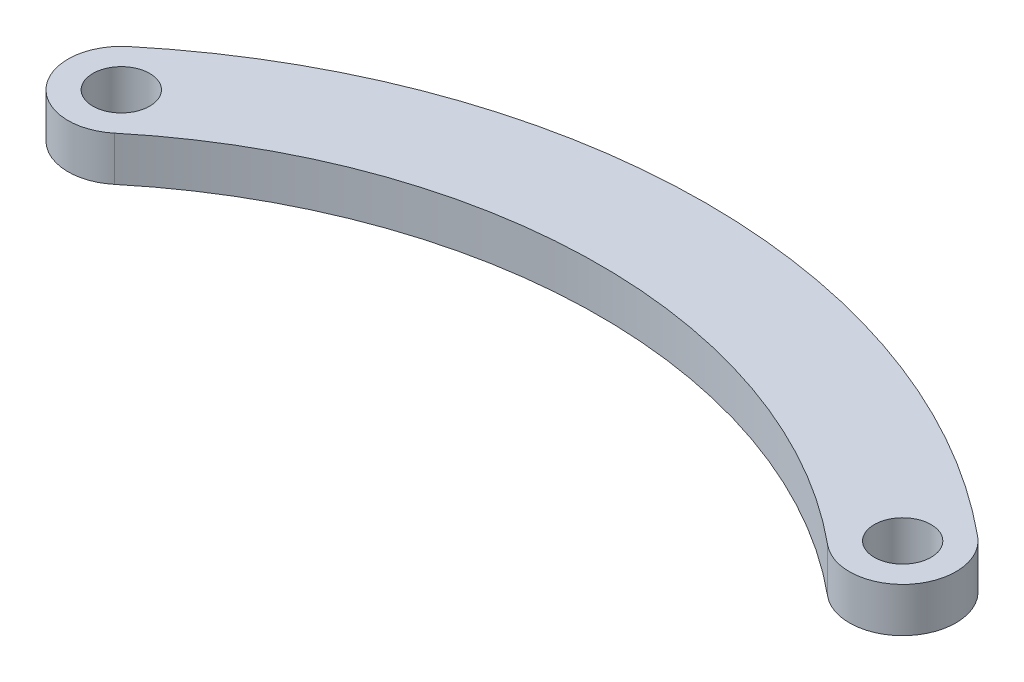
ISO-10303-21;
HEADER;
FILE_DESCRIPTION(('STEP AP214'),'2;1');
FILE_NAME('part.step','',(''),(''),'','','');
FILE_SCHEMA(('AUTOMOTIVE_DESIGN { 1 0 10303 214 1 1 1 1 }'));
ENDSEC;
DATA;
#1=APPLICATION_CONTEXT('core data for automotive mechanical design processes');
#2=APPLICATION_PROTOCOL_DEFINITION('international standard','automotive_design',2000,#1);
#3=PRODUCT_CONTEXT('',#1,'mechanical');
#4=PRODUCT('Part','Part','',(#3));
#5=PRODUCT_RELATED_PRODUCT_CATEGORY('part','',(#4));
#6=PRODUCT_DEFINITION_FORMATION('','',#4);
#7=PRODUCT_DEFINITION_CONTEXT('part definition',#1,'design');
#8=PRODUCT_DEFINITION('design','',#6,#7);
#9=PRODUCT_DEFINITION_SHAPE('','',#8);
#10=(LENGTH_UNIT() NAMED_UNIT(*) SI_UNIT(.MILLI.,.METRE.));
#11=(NAMED_UNIT(*) PLANE_ANGLE_UNIT() SI_UNIT($,.RADIAN.));
#12=(NAMED_UNIT(*) SI_UNIT($,.STERADIAN.) SOLID_ANGLE_UNIT());
#13=UNCERTAINTY_MEASURE_WITH_UNIT(LENGTH_MEASURE(1.E-05),#10,'distance_accuracy_value','');
#14=(GEOMETRIC_REPRESENTATION_CONTEXT(3) GLOBAL_UNCERTAINTY_ASSIGNED_CONTEXT((#13)) GLOBAL_UNIT_ASSIGNED_CONTEXT((#10,
#11,#12)) REPRESENTATION_CONTEXT('',''));
#15=CARTESIAN_POINT('',(0.,0.,0.));
#16=DIRECTION('',(0.,0.,1.));
#17=DIRECTION('',(1.,0.,0.));
#18=AXIS2_PLACEMENT_3D('',#15,#16,#17);
#19=CARTESIAN_POINT('',(33.,2.5,13.2589572246069));
#20=DIRECTION('',(0.,1.,0.));
#21=DIRECTION('',(0.,0.,1.));
#22=AXIS2_PLACEMENT_3D('',#19,#20,#21);
#23=PLANE('',#22);
#24=CARTESIAN_POINT('',(0.,2.5,0.));
#25=DIRECTION('',(0.,1.,0.));
#26=DIRECTION('',(0.,0.,1.));
#27=AXIS2_PLACEMENT_3D('',#24,#25,#26);
#28=CIRCLE('',#27,1.6);
#29=CARTESIAN_POINT('',(0.,2.5,1.6));
#30=VERTEX_POINT('',#29);
#31=EDGE_CURVE('E104',#30,#30,#28,.T.);
#32=ORIENTED_EDGE('',*,*,#31,.F.);
#33=EDGE_LOOP('',(#32));
#34=FACE_BOUND('',#33,.T.);
#35=CARTESIAN_POINT('',(44.,2.5,0.));
#36=DIRECTION('',(0.,1.,0.));
#37=DIRECTION('',(0.,0.,1.));
#38=AXIS2_PLACEMENT_3D('',#35,#36,#37);
#39=CIRCLE('',#38,3.);
#40=CARTESIAN_POINT('',(42.0845005545766,2.5,2.3088659282389));
#41=VERTEX_POINT('',#40);
#42=CARTESIAN_POINT('',(45.9154994454234,2.5,-2.3088659282389));
#43=VERTEX_POINT('',#42);
#44=EDGE_CURVE('E89',#41,#43,#39,.T.);
#45=ORIENTED_EDGE('',*,*,#44,.T.);
#46=CARTESIAN_POINT('',(22.,2.5,26.5179144492139));
#47=DIRECTION('',(0.,1.,0.));
#48=DIRECTION('',(0.,0.,1.));
#49=AXIS2_PLACEMENT_3D('',#46,#47,#48);
#50=CIRCLE('',#49,37.4557656530199);
#51=CARTESIAN_POINT('',(-1.91549944542345,2.5,-2.30886592823891));
#52=VERTEX_POINT('',#51);
#53=EDGE_CURVE('E84',#43,#52,#50,.T.);
#54=ORIENTED_EDGE('',*,*,#53,.T.);
#55=CARTESIAN_POINT('',(0.,2.5,0.));
#56=DIRECTION('',(0.,1.,0.));
#57=DIRECTION('',(0.,0.,1.));
#58=AXIS2_PLACEMENT_3D('',#55,#56,#57);
#59=CIRCLE('',#58,3.);
#60=CARTESIAN_POINT('',(1.91549944542344,2.5,2.30886592823889));
#61=VERTEX_POINT('',#60);
#62=EDGE_CURVE('E87',#52,#61,#59,.T.);
#63=ORIENTED_EDGE('',*,*,#62,.T.);
#64=CARTESIAN_POINT('',(22.,2.5,26.5179144492139));
#65=DIRECTION('',(0.,-1.,0.));
#66=DIRECTION('',(0.,0.,1.));
#67=AXIS2_PLACEMENT_3D('',#64,#65,#66);
#68=CIRCLE('',#67,31.4557656530199);
#69=EDGE_CURVE('E54',#61,#41,#68,.T.);
#70=ORIENTED_EDGE('',*,*,#69,.T.);
#71=EDGE_LOOP('',(#45,#54,#63,#70));
#72=FACE_BOUND('',#71,.T.);
#73=CARTESIAN_POINT('',(44.,2.5,0.));
#74=DIRECTION('',(0.,1.,0.));
#75=DIRECTION('',(0.,0.,1.));
#76=AXIS2_PLACEMENT_3D('',#73,#74,#75);
#77=CIRCLE('',#76,1.6);
#78=CARTESIAN_POINT('',(44.,2.5,1.6));
#79=VERTEX_POINT('',#78);
#80=EDGE_CURVE('E119',#79,#79,#77,.T.);
#81=ORIENTED_EDGE('',*,*,#80,.F.);
#82=EDGE_LOOP('',(#81));
#83=FACE_BOUND('',#82,.T.);
#84=ADVANCED_FACE('F37',(#34,#72,#83),#23,.T.);
#85=CARTESIAN_POINT('',(33.,0.,13.2589572246069));
#86=DIRECTION('',(0.,1.,0.));
#87=DIRECTION('',(0.,0.,1.));
#88=AXIS2_PLACEMENT_3D('',#85,#86,#87);
#89=PLANE('',#88);
#90=CARTESIAN_POINT('',(44.,0.,0.));
#91=DIRECTION('',(0.,1.,0.));
#92=DIRECTION('',(0.,0.,1.));
#93=AXIS2_PLACEMENT_3D('',#90,#91,#92);
#94=CIRCLE('',#93,3.);
#95=CARTESIAN_POINT('',(42.0845005545766,0.,2.3088659282389));
#96=VERTEX_POINT('',#95);
#97=CARTESIAN_POINT('',(45.9154994454234,0.,-2.3088659282389));
#98=VERTEX_POINT('',#97);
#99=EDGE_CURVE('E101',#96,#98,#94,.T.);
#100=ORIENTED_EDGE('',*,*,#99,.F.);
#101=CARTESIAN_POINT('',(22.,0.,26.5179144492139));
#102=DIRECTION('',(0.,-1.,0.));
#103=DIRECTION('',(0.,0.,1.));
#104=AXIS2_PLACEMENT_3D('',#101,#102,#103);
#105=CIRCLE('',#104,31.4557656530199);
#106=CARTESIAN_POINT('',(1.91549944542344,0.,2.30886592823889));
#107=VERTEX_POINT('',#106);
#108=EDGE_CURVE('E77',#107,#96,#105,.T.);
#109=ORIENTED_EDGE('',*,*,#108,.F.);
#110=CARTESIAN_POINT('',(0.,0.,0.));
#111=DIRECTION('',(0.,1.,0.));
#112=DIRECTION('',(0.,0.,1.));
#113=AXIS2_PLACEMENT_3D('',#110,#111,#112);
#114=CIRCLE('',#113,3.);
#115=CARTESIAN_POINT('',(-1.91549944542345,0.,-2.30886592823891));
#116=VERTEX_POINT('',#115);
#117=EDGE_CURVE('E71',#116,#107,#114,.T.);
#118=ORIENTED_EDGE('',*,*,#117,.F.);
#119=CARTESIAN_POINT('',(22.,0.,26.5179144492139));
#120=DIRECTION('',(0.,1.,0.));
#121=DIRECTION('',(0.,0.,1.));
#122=AXIS2_PLACEMENT_3D('',#119,#120,#121);
#123=CIRCLE('',#122,37.4557656530199);
#124=EDGE_CURVE('E93',#98,#116,#123,.T.);
#125=ORIENTED_EDGE('',*,*,#124,.F.);
#126=EDGE_LOOP('',(#100,#109,#118,#125));
#127=FACE_BOUND('',#126,.T.);
#128=CARTESIAN_POINT('',(0.,0.,0.));
#129=DIRECTION('',(0.,1.,0.));
#130=DIRECTION('',(0.,0.,1.));
#131=AXIS2_PLACEMENT_3D('',#128,#129,#130);
#132=CIRCLE('',#131,1.6);
#133=CARTESIAN_POINT('',(0.,0.,1.6));
#134=VERTEX_POINT('',#133);
#135=EDGE_CURVE('E116',#134,#134,#132,.T.);
#136=ORIENTED_EDGE('',*,*,#135,.T.);
#137=EDGE_LOOP('',(#136));
#138=FACE_BOUND('',#137,.T.);
#139=CARTESIAN_POINT('',(44.,0.,0.));
#140=DIRECTION('',(0.,1.,0.));
#141=DIRECTION('',(0.,0.,1.));
#142=AXIS2_PLACEMENT_3D('',#139,#140,#141);
#143=CIRCLE('',#142,1.6);
#144=CARTESIAN_POINT('',(44.,0.,1.6));
#145=VERTEX_POINT('',#144);
#146=EDGE_CURVE('E122',#145,#145,#143,.T.);
#147=ORIENTED_EDGE('',*,*,#146,.T.);
#148=EDGE_LOOP('',(#147));
#149=FACE_BOUND('',#148,.T.);
#150=ADVANCED_FACE('F112',(#127,#138,#149),#89,.F.);
#151=CARTESIAN_POINT('',(44.,2.5,0.));
#152=DIRECTION('',(0.,-1.,0.));
#153=DIRECTION('',(0.,0.,-1.));
#154=AXIS2_PLACEMENT_3D('',#151,#152,#153);
#155=CYLINDRICAL_SURFACE('',#154,3.);
#156=ORIENTED_EDGE('',*,*,#99,.T.);
#157=DIRECTION('',(0.,-1.,0.));
#158=VECTOR('',#157,1.);
#159=CARTESIAN_POINT('',(45.9154994454234,2.5,-2.3088659282389));
#160=LINE('',#159,#158);
#161=EDGE_CURVE('E11',#43,#98,#160,.T.);
#162=ORIENTED_EDGE('',*,*,#161,.F.);
#163=ORIENTED_EDGE('',*,*,#44,.F.);
#164=DIRECTION('',(0.,-1.,0.));
#165=VECTOR('',#164,1.);
#166=CARTESIAN_POINT('',(42.0845005545766,2.5,2.3088659282389));
#167=LINE('',#166,#165);
#168=EDGE_CURVE('E97',#41,#96,#167,.T.);
#169=ORIENTED_EDGE('',*,*,#168,.T.);
#170=EDGE_LOOP('',(#156,#162,#163,#169));
#171=FACE_BOUND('',#170,.T.);
#172=ADVANCED_FACE('F39',(#171),#155,.T.);
#173=CARTESIAN_POINT('',(22.,2.5,26.5179144492139));
#174=DIRECTION('',(0.,-1.,0.));
#175=DIRECTION('',(0.,0.,-1.));
#176=AXIS2_PLACEMENT_3D('',#173,#174,#175);
#177=CYLINDRICAL_SURFACE('',#176,37.4557656530199);
#178=ORIENTED_EDGE('',*,*,#124,.T.);
#179=DIRECTION('',(0.,-1.,0.));
#180=VECTOR('',#179,1.);
#181=CARTESIAN_POINT('',(-1.91549944542345,2.5,-2.30886592823891));
#182=LINE('',#181,#180);
#183=EDGE_CURVE('E46',#52,#116,#182,.T.);
#184=ORIENTED_EDGE('',*,*,#183,.F.);
#185=ORIENTED_EDGE('',*,*,#53,.F.);
#186=ORIENTED_EDGE('',*,*,#161,.T.);
#187=EDGE_LOOP('',(#178,#184,#185,#186));
#188=FACE_BOUND('',#187,.T.);
#189=ADVANCED_FACE('F92',(#188),#177,.T.);
#190=CARTESIAN_POINT('',(0.,2.5,0.));
#191=DIRECTION('',(0.,-1.,0.));
#192=DIRECTION('',(0.,0.,-1.));
#193=AXIS2_PLACEMENT_3D('',#190,#191,#192);
#194=CYLINDRICAL_SURFACE('',#193,3.);
#195=ORIENTED_EDGE('',*,*,#117,.T.);
#196=DIRECTION('',(0.,-1.,0.));
#197=VECTOR('',#196,1.);
#198=CARTESIAN_POINT('',(1.91549944542344,2.5,2.30886592823889));
#199=LINE('',#198,#197);
#200=EDGE_CURVE('E94',#61,#107,#199,.T.);
#201=ORIENTED_EDGE('',*,*,#200,.F.);
#202=ORIENTED_EDGE('',*,*,#62,.F.);
#203=ORIENTED_EDGE('',*,*,#183,.T.);
#204=EDGE_LOOP('',(#195,#201,#202,#203));
#205=FACE_BOUND('',#204,.T.);
#206=ADVANCED_FACE('F95',(#205),#194,.T.);
#207=CARTESIAN_POINT('',(22.,2.5,26.5179144492139));
#208=DIRECTION('',(0.,-1.,0.));
#209=DIRECTION('',(0.,0.,-1.));
#210=AXIS2_PLACEMENT_3D('',#207,#208,#209);
#211=CYLINDRICAL_SURFACE('',#210,31.4557656530199);
#212=ORIENTED_EDGE('',*,*,#108,.T.);
#213=ORIENTED_EDGE('',*,*,#168,.F.);
#214=ORIENTED_EDGE('',*,*,#69,.F.);
#215=ORIENTED_EDGE('',*,*,#200,.T.);
#216=EDGE_LOOP('',(#212,#213,#214,#215));
#217=FACE_BOUND('',#216,.T.);
#218=ADVANCED_FACE('F109',(#217),#211,.F.);
#219=CARTESIAN_POINT('',(0.,2.5,0.));
#220=DIRECTION('',(0.,-1.,0.));
#221=DIRECTION('',(0.,0.,-1.));
#222=AXIS2_PLACEMENT_3D('',#219,#220,#221);
#223=CYLINDRICAL_SURFACE('',#222,1.6);
#224=ORIENTED_EDGE('',*,*,#31,.T.);
#225=EDGE_LOOP('',(#224));
#226=FACE_BOUND('',#225,.T.);
#227=ORIENTED_EDGE('',*,*,#135,.F.);
#228=EDGE_LOOP('',(#227));
#229=FACE_BOUND('',#228,.T.);
#230=ADVANCED_FACE('F139',(#226,#229),#223,.F.);
#231=CARTESIAN_POINT('',(44.,2.5,0.));
#232=DIRECTION('',(0.,-1.,0.));
#233=DIRECTION('',(0.,0.,-1.));
#234=AXIS2_PLACEMENT_3D('',#231,#232,#233);
#235=CYLINDRICAL_SURFACE('',#234,1.6);
#236=ORIENTED_EDGE('',*,*,#80,.T.);
#237=EDGE_LOOP('',(#236));
#238=FACE_BOUND('',#237,.T.);
#239=ORIENTED_EDGE('',*,*,#146,.F.);
#240=EDGE_LOOP('',(#239));
#241=FACE_BOUND('',#240,.T.);
#242=ADVANCED_FACE('F128',(#238,#241),#235,.F.);
#243=CLOSED_SHELL('',(#84,#150,#172,#189,#206,#218,#230,#242));
#244=MANIFOLD_SOLID_BREP('B2',#243);
#245=ADVANCED_BREP_SHAPE_REPRESENTATION('',(#18,#244),#14);
#246=SHAPE_DEFINITION_REPRESENTATION(#9,#245);
ENDSEC;
END-ISO-10303-21;
